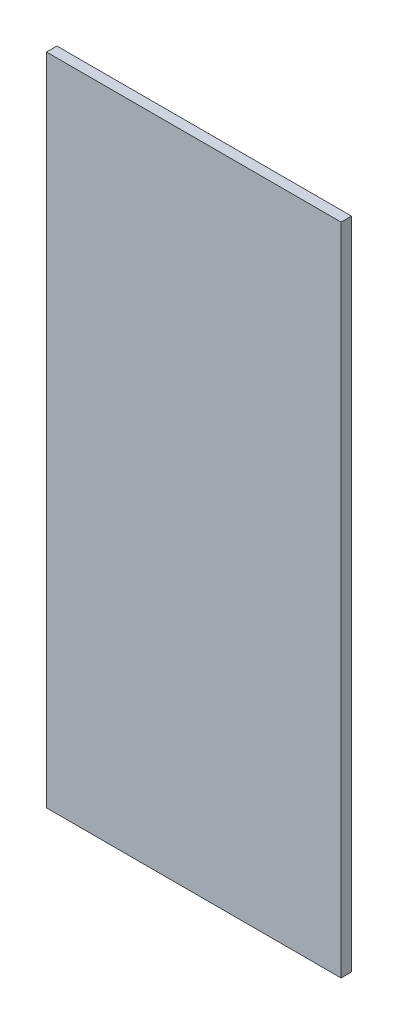
ISO-10303-21;
HEADER;
FILE_DESCRIPTION(('STEP AP214'),'2;1');
FILE_NAME('part.step','',(''),(''),'','','');
FILE_SCHEMA(('AUTOMOTIVE_DESIGN { 1 0 10303 214 1 1 1 1 }'));
ENDSEC;
DATA;
#1=APPLICATION_CONTEXT('core data for automotive mechanical design processes');
#2=APPLICATION_PROTOCOL_DEFINITION('international standard','automotive_design',2000,#1);
#3=PRODUCT_CONTEXT('',#1,'mechanical');
#4=PRODUCT('Part','Part','',(#3));
#5=PRODUCT_RELATED_PRODUCT_CATEGORY('part','',(#4));
#6=PRODUCT_DEFINITION_FORMATION('','',#4);
#7=PRODUCT_DEFINITION_CONTEXT('part definition',#1,'design');
#8=PRODUCT_DEFINITION('design','',#6,#7);
#9=PRODUCT_DEFINITION_SHAPE('','',#8);
#10=(LENGTH_UNIT() NAMED_UNIT(*) SI_UNIT(.MILLI.,.METRE.));
#11=(NAMED_UNIT(*) PLANE_ANGLE_UNIT() SI_UNIT($,.RADIAN.));
#12=(NAMED_UNIT(*) SI_UNIT($,.STERADIAN.) SOLID_ANGLE_UNIT());
#13=UNCERTAINTY_MEASURE_WITH_UNIT(LENGTH_MEASURE(1.E-05),#10,'distance_accuracy_value','');
#14=(GEOMETRIC_REPRESENTATION_CONTEXT(3) GLOBAL_UNCERTAINTY_ASSIGNED_CONTEXT((#13)) GLOBAL_UNIT_ASSIGNED_CONTEXT((#10,
#11,#12)) REPRESENTATION_CONTEXT('',''));
#15=CARTESIAN_POINT('',(0.,0.,0.));
#16=DIRECTION('',(0.,0.,1.));
#17=DIRECTION('',(1.,0.,0.));
#18=AXIS2_PLACEMENT_3D('',#15,#16,#17);
#19=CARTESIAN_POINT('',(-45.,-100.,3.175));
#20=DIRECTION('',(1.,0.,0.));
#21=DIRECTION('',(0.,0.,-1.));
#22=AXIS2_PLACEMENT_3D('',#19,#20,#21);
#23=PLANE('',#22);
#24=DIRECTION('',(0.,-1.,0.));
#25=VECTOR('',#24,1.);
#26=CARTESIAN_POINT('',(-45.,-100.,0.));
#27=LINE('',#26,#25);
#28=CARTESIAN_POINT('',(-45.,100.,0.));
#29=VERTEX_POINT('',#28);
#30=CARTESIAN_POINT('',(-45.,-100.,0.));
#31=VERTEX_POINT('',#30);
#32=EDGE_CURVE('E96',#29,#31,#27,.T.);
#33=ORIENTED_EDGE('',*,*,#32,.T.);
#34=DIRECTION('',(0.,0.,-1.));
#35=VECTOR('',#34,1.);
#36=CARTESIAN_POINT('',(-45.,-100.,3.175));
#37=LINE('',#36,#35);
#38=CARTESIAN_POINT('',(-45.,-100.,3.175));
#39=VERTEX_POINT('',#38);
#40=EDGE_CURVE('E11',#39,#31,#37,.T.);
#41=ORIENTED_EDGE('',*,*,#40,.F.);
#42=DIRECTION('',(0.,-1.,0.));
#43=VECTOR('',#42,1.);
#44=CARTESIAN_POINT('',(-45.,-100.,3.175));
#45=LINE('',#44,#43);
#46=CARTESIAN_POINT('',(-45.,100.,3.175));
#47=VERTEX_POINT('',#46);
#48=EDGE_CURVE('E84',#47,#39,#45,.T.);
#49=ORIENTED_EDGE('',*,*,#48,.F.);
#50=DIRECTION('',(0.,0.,-1.));
#51=VECTOR('',#50,1.);
#52=CARTESIAN_POINT('',(-45.,100.,3.175));
#53=LINE('',#52,#51);
#54=EDGE_CURVE('E92',#47,#29,#53,.T.);
#55=ORIENTED_EDGE('',*,*,#54,.T.);
#56=EDGE_LOOP('',(#33,#41,#49,#55));
#57=FACE_BOUND('',#56,.T.);
#58=ADVANCED_FACE('F33',(#57),#23,.F.);
#59=CARTESIAN_POINT('',(45.,-100.,3.175));
#60=DIRECTION('',(0.,1.,0.));
#61=DIRECTION('',(0.,0.,1.));
#62=AXIS2_PLACEMENT_3D('',#59,#60,#61);
#63=PLANE('',#62);
#64=DIRECTION('',(1.,0.,0.));
#65=VECTOR('',#64,1.);
#66=CARTESIAN_POINT('',(45.,-100.,0.));
#67=LINE('',#66,#65);
#68=CARTESIAN_POINT('',(45.,-100.,0.));
#69=VERTEX_POINT('',#68);
#70=EDGE_CURVE('E88',#31,#69,#67,.T.);
#71=ORIENTED_EDGE('',*,*,#70,.T.);
#72=DIRECTION('',(0.,0.,-1.));
#73=VECTOR('',#72,1.);
#74=CARTESIAN_POINT('',(45.,-100.,3.175));
#75=LINE('',#74,#73);
#76=CARTESIAN_POINT('',(45.,-100.,3.175));
#77=VERTEX_POINT('',#76);
#78=EDGE_CURVE('E41',#77,#69,#75,.T.);
#79=ORIENTED_EDGE('',*,*,#78,.F.);
#80=DIRECTION('',(1.,0.,0.));
#81=VECTOR('',#80,1.);
#82=CARTESIAN_POINT('',(45.,-100.,3.175));
#83=LINE('',#82,#81);
#84=EDGE_CURVE('E79',#39,#77,#83,.T.);
#85=ORIENTED_EDGE('',*,*,#84,.F.);
#86=ORIENTED_EDGE('',*,*,#40,.T.);
#87=EDGE_LOOP('',(#71,#79,#85,#86));
#88=FACE_BOUND('',#87,.T.);
#89=ADVANCED_FACE('F87',(#88),#63,.F.);
#90=CARTESIAN_POINT('',(45.,-100.,3.175));
#91=DIRECTION('',(-1.,0.,0.));
#92=DIRECTION('',(0.,0.,1.));
#93=AXIS2_PLACEMENT_3D('',#90,#91,#92);
#94=PLANE('',#93);
#95=DIRECTION('',(0.,1.,0.));
#96=VECTOR('',#95,1.);
#97=CARTESIAN_POINT('',(45.,-100.,0.));
#98=LINE('',#97,#96);
#99=CARTESIAN_POINT('',(45.,100.,0.));
#100=VERTEX_POINT('',#99);
#101=EDGE_CURVE('E66',#69,#100,#98,.T.);
#102=ORIENTED_EDGE('',*,*,#101,.T.);
#103=DIRECTION('',(0.,0.,-1.));
#104=VECTOR('',#103,1.);
#105=CARTESIAN_POINT('',(45.,100.,3.175));
#106=LINE('',#105,#104);
#107=CARTESIAN_POINT('',(45.,100.,3.175));
#108=VERTEX_POINT('',#107);
#109=EDGE_CURVE('E89',#108,#100,#106,.T.);
#110=ORIENTED_EDGE('',*,*,#109,.F.);
#111=DIRECTION('',(0.,1.,0.));
#112=VECTOR('',#111,1.);
#113=CARTESIAN_POINT('',(45.,-100.,3.175));
#114=LINE('',#113,#112);
#115=EDGE_CURVE('E82',#77,#108,#114,.T.);
#116=ORIENTED_EDGE('',*,*,#115,.F.);
#117=ORIENTED_EDGE('',*,*,#78,.T.);
#118=EDGE_LOOP('',(#102,#110,#116,#117));
#119=FACE_BOUND('',#118,.T.);
#120=ADVANCED_FACE('F90',(#119),#94,.F.);
#121=CARTESIAN_POINT('',(45.,100.,3.175));
#122=DIRECTION('',(0.,-1.,0.));
#123=DIRECTION('',(1.,0.,0.));
#124=AXIS2_PLACEMENT_3D('',#121,#122,#123);
#125=PLANE('',#124);
#126=DIRECTION('',(-1.,0.,0.));
#127=VECTOR('',#126,1.);
#128=CARTESIAN_POINT('',(45.,100.,0.));
#129=LINE('',#128,#127);
#130=EDGE_CURVE('E72',#100,#29,#129,.T.);
#131=ORIENTED_EDGE('',*,*,#130,.T.);
#132=ORIENTED_EDGE('',*,*,#54,.F.);
#133=DIRECTION('',(-1.,0.,0.));
#134=VECTOR('',#133,1.);
#135=CARTESIAN_POINT('',(45.,100.,3.175));
#136=LINE('',#135,#134);
#137=EDGE_CURVE('E49',#108,#47,#136,.T.);
#138=ORIENTED_EDGE('',*,*,#137,.F.);
#139=ORIENTED_EDGE('',*,*,#109,.T.);
#140=EDGE_LOOP('',(#131,#132,#138,#139));
#141=FACE_BOUND('',#140,.T.);
#142=ADVANCED_FACE('F103',(#141),#125,.F.);
#143=CARTESIAN_POINT('',(0.,0.,3.175));
#144=DIRECTION('',(0.,0.,1.));
#145=DIRECTION('',(1.,0.,0.));
#146=AXIS2_PLACEMENT_3D('',#143,#144,#145);
#147=PLANE('',#146);
#148=ORIENTED_EDGE('',*,*,#48,.T.);
#149=ORIENTED_EDGE('',*,*,#84,.T.);
#150=ORIENTED_EDGE('',*,*,#115,.T.);
#151=ORIENTED_EDGE('',*,*,#137,.T.);
#152=EDGE_LOOP('',(#148,#149,#150,#151));
#153=FACE_BOUND('',#152,.T.);
#154=ADVANCED_FACE('F80',(#153),#147,.T.);
#155=CARTESIAN_POINT('',(0.,0.,0.));
#156=DIRECTION('',(0.,0.,1.));
#157=DIRECTION('',(1.,0.,0.));
#158=AXIS2_PLACEMENT_3D('',#155,#156,#157);
#159=PLANE('',#158);
#160=ORIENTED_EDGE('',*,*,#32,.F.);
#161=ORIENTED_EDGE('',*,*,#130,.F.);
#162=ORIENTED_EDGE('',*,*,#101,.F.);
#163=ORIENTED_EDGE('',*,*,#70,.F.);
#164=EDGE_LOOP('',(#160,#161,#162,#163));
#165=FACE_BOUND('',#164,.T.);
#166=ADVANCED_FACE('F106',(#165),#159,.F.);
#167=CLOSED_SHELL('',(#58,#89,#120,#142,#154,#166));
#168=MANIFOLD_SOLID_BREP('B2',#167);
#169=ADVANCED_BREP_SHAPE_REPRESENTATION('',(#18,#168),#14);
#170=SHAPE_DEFINITION_REPRESENTATION(#9,#169);
ENDSEC;
END-ISO-10303-21;
